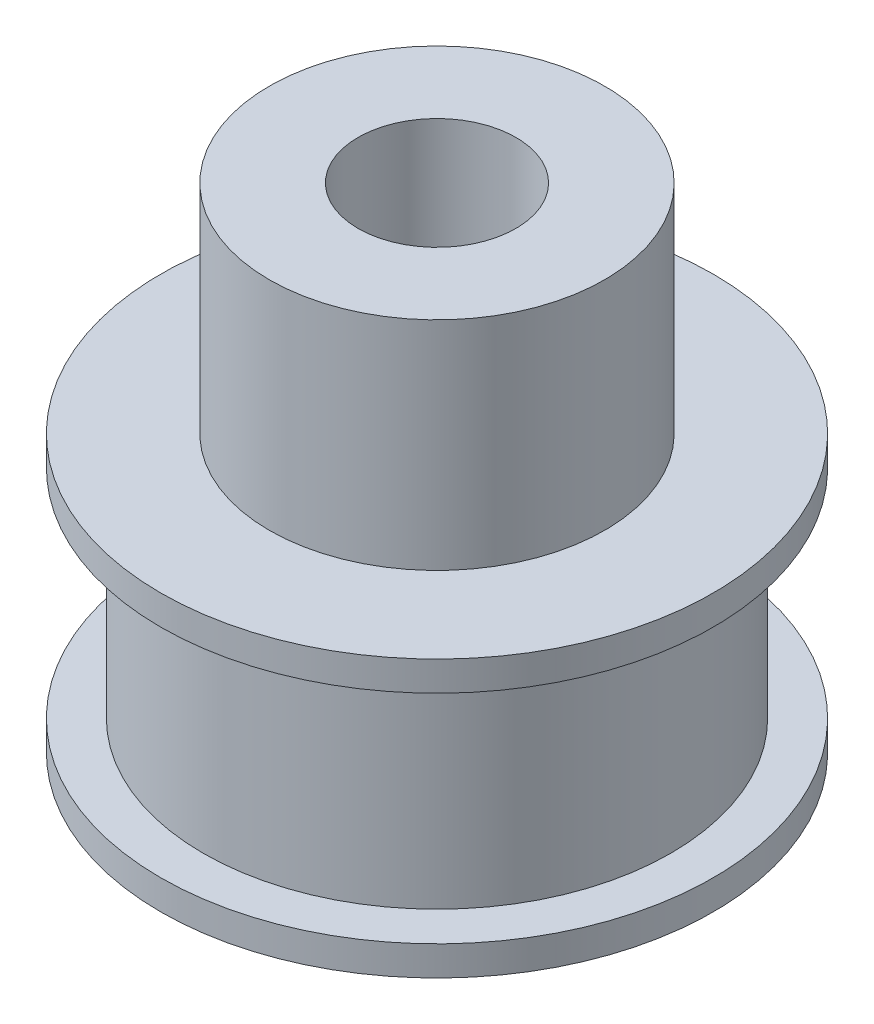
ISO-10303-21;
HEADER;
FILE_DESCRIPTION(('STEP AP214'),'2;1');
FILE_NAME('part.step','',(''),(''),'','','');
FILE_SCHEMA(('AUTOMOTIVE_DESIGN { 1 0 10303 214 1 1 1 1 }'));
ENDSEC;
DATA;
#1=APPLICATION_CONTEXT('core data for automotive mechanical design processes');
#2=APPLICATION_PROTOCOL_DEFINITION('international standard','automotive_design',2000,#1);
#3=PRODUCT_CONTEXT('',#1,'mechanical');
#4=PRODUCT('Part','Part','',(#3));
#5=PRODUCT_RELATED_PRODUCT_CATEGORY('part','',(#4));
#6=PRODUCT_DEFINITION_FORMATION('','',#4);
#7=PRODUCT_DEFINITION_CONTEXT('part definition',#1,'design');
#8=PRODUCT_DEFINITION('design','',#6,#7);
#9=PRODUCT_DEFINITION_SHAPE('','',#8);
#10=(LENGTH_UNIT() NAMED_UNIT(*) SI_UNIT(.MILLI.,.METRE.));
#11=(NAMED_UNIT(*) PLANE_ANGLE_UNIT() SI_UNIT($,.RADIAN.));
#12=(NAMED_UNIT(*) SI_UNIT($,.STERADIAN.) SOLID_ANGLE_UNIT());
#13=UNCERTAINTY_MEASURE_WITH_UNIT(LENGTH_MEASURE(1.E-05),#10,'distance_accuracy_value','');
#14=(GEOMETRIC_REPRESENTATION_CONTEXT(3) GLOBAL_UNCERTAINTY_ASSIGNED_CONTEXT((#13)) GLOBAL_UNIT_ASSIGNED_CONTEXT((#10,
#11,#12)) REPRESENTATION_CONTEXT('',''));
#15=CARTESIAN_POINT('',(0.,0.,0.));
#16=DIRECTION('',(0.,0.,1.));
#17=DIRECTION('',(1.,0.,0.));
#18=AXIS2_PLACEMENT_3D('',#15,#16,#17);
#19=CARTESIAN_POINT('',(0.,1.5,0.));
#20=DIRECTION('',(0.,-1.,0.));
#21=DIRECTION('',(0.,0.,-1.));
#22=AXIS2_PLACEMENT_3D('',#19,#20,#21);
#23=CYLINDRICAL_SURFACE('',#22,14.);
#24=CARTESIAN_POINT('',(0.,1.5,0.));
#25=DIRECTION('',(0.,1.,0.));
#26=DIRECTION('',(0.,0.,1.));
#27=AXIS2_PLACEMENT_3D('',#24,#25,#26);
#28=CIRCLE('',#27,14.);
#29=CARTESIAN_POINT('',(0.,1.5,14.));
#30=VERTEX_POINT('',#29);
#31=EDGE_CURVE('E10',#30,#30,#28,.T.);
#32=ORIENTED_EDGE('',*,*,#31,.F.);
#33=EDGE_LOOP('',(#32));
#34=FACE_BOUND('',#33,.T.);
#35=CARTESIAN_POINT('',(0.,0.,0.));
#36=DIRECTION('',(0.,1.,0.));
#37=DIRECTION('',(0.,0.,1.));
#38=AXIS2_PLACEMENT_3D('',#35,#36,#37);
#39=CIRCLE('',#38,14.);
#40=CARTESIAN_POINT('',(0.,0.,14.));
#41=VERTEX_POINT('',#40);
#42=EDGE_CURVE('E41',#41,#41,#39,.T.);
#43=ORIENTED_EDGE('',*,*,#42,.T.);
#44=EDGE_LOOP('',(#43));
#45=FACE_BOUND('',#44,.T.);
#46=ADVANCED_FACE('F38',(#34,#45),#23,.T.);
#47=CARTESIAN_POINT('',(0.,1.5,0.));
#48=DIRECTION('',(0.,1.,0.));
#49=DIRECTION('',(0.,0.,1.));
#50=AXIS2_PLACEMENT_3D('',#47,#48,#49);
#51=PLANE('',#50);
#52=CARTESIAN_POINT('',(0.,1.5,0.));
#53=DIRECTION('',(0.,1.,0.));
#54=DIRECTION('',(0.,0.,1.));
#55=AXIS2_PLACEMENT_3D('',#52,#53,#54);
#56=CIRCLE('',#55,11.85);
#57=CARTESIAN_POINT('',(0.,1.5,11.85));
#58=VERTEX_POINT('',#57);
#59=EDGE_CURVE('E52',#58,#58,#56,.T.);
#60=ORIENTED_EDGE('',*,*,#59,.F.);
#61=EDGE_LOOP('',(#60));
#62=FACE_BOUND('',#61,.T.);
#63=ORIENTED_EDGE('',*,*,#31,.T.);
#64=EDGE_LOOP('',(#63));
#65=FACE_BOUND('',#64,.T.);
#66=ADVANCED_FACE('F125',(#62,#65),#51,.T.);
#67=CARTESIAN_POINT('',(0.,0.,0.));
#68=DIRECTION('',(0.,1.,0.));
#69=DIRECTION('',(0.,0.,1.));
#70=AXIS2_PLACEMENT_3D('',#67,#68,#69);
#71=PLANE('',#70);
#72=CARTESIAN_POINT('',(0.,0.,0.));
#73=DIRECTION('',(0.,1.,0.));
#74=DIRECTION('',(0.,0.,1.));
#75=AXIS2_PLACEMENT_3D('',#72,#73,#74);
#76=CIRCLE('',#75,4.);
#77=CARTESIAN_POINT('',(0.,0.,4.));
#78=VERTEX_POINT('',#77);
#79=EDGE_CURVE('E72',#78,#78,#76,.T.);
#80=ORIENTED_EDGE('',*,*,#79,.T.);
#81=EDGE_LOOP('',(#80));
#82=FACE_BOUND('',#81,.T.);
#83=ORIENTED_EDGE('',*,*,#42,.F.);
#84=EDGE_LOOP('',(#83));
#85=FACE_BOUND('',#84,.T.);
#86=ADVANCED_FACE('F84',(#82,#85),#71,.F.);
#87=CARTESIAN_POINT('',(0.,12.5,0.));
#88=DIRECTION('',(0.,-1.,0.));
#89=DIRECTION('',(0.,0.,-1.));
#90=AXIS2_PLACEMENT_3D('',#87,#88,#89);
#91=CYLINDRICAL_SURFACE('',#90,11.85);
#92=CARTESIAN_POINT('',(0.,12.5,0.));
#93=DIRECTION('',(0.,1.,0.));
#94=DIRECTION('',(0.,0.,1.));
#95=AXIS2_PLACEMENT_3D('',#92,#93,#94);
#96=CIRCLE('',#95,11.85);
#97=CARTESIAN_POINT('',(0.,12.5,11.85));
#98=VERTEX_POINT('',#97);
#99=EDGE_CURVE('E50',#98,#98,#96,.T.);
#100=ORIENTED_EDGE('',*,*,#99,.F.);
#101=EDGE_LOOP('',(#100));
#102=FACE_BOUND('',#101,.T.);
#103=ORIENTED_EDGE('',*,*,#59,.T.);
#104=EDGE_LOOP('',(#103));
#105=FACE_BOUND('',#104,.T.);
#106=ADVANCED_FACE('F115',(#102,#105),#91,.T.);
#107=CARTESIAN_POINT('',(0.,14.,0.));
#108=DIRECTION('',(0.,-1.,0.));
#109=DIRECTION('',(0.,0.,-1.));
#110=AXIS2_PLACEMENT_3D('',#107,#108,#109);
#111=CYLINDRICAL_SURFACE('',#110,14.);
#112=CARTESIAN_POINT('',(0.,14.,0.));
#113=DIRECTION('',(0.,1.,0.));
#114=DIRECTION('',(0.,0.,1.));
#115=AXIS2_PLACEMENT_3D('',#112,#113,#114);
#116=CIRCLE('',#115,14.);
#117=CARTESIAN_POINT('',(0.,14.,14.));
#118=VERTEX_POINT('',#117);
#119=EDGE_CURVE('E56',#118,#118,#116,.T.);
#120=ORIENTED_EDGE('',*,*,#119,.F.);
#121=EDGE_LOOP('',(#120));
#122=FACE_BOUND('',#121,.T.);
#123=CARTESIAN_POINT('',(0.,12.5,0.));
#124=DIRECTION('',(0.,1.,0.));
#125=DIRECTION('',(0.,0.,1.));
#126=AXIS2_PLACEMENT_3D('',#123,#124,#125);
#127=CIRCLE('',#126,14.);
#128=CARTESIAN_POINT('',(0.,12.5,14.));
#129=VERTEX_POINT('',#128);
#130=EDGE_CURVE('E60',#129,#129,#127,.T.);
#131=ORIENTED_EDGE('',*,*,#130,.T.);
#132=EDGE_LOOP('',(#131));
#133=FACE_BOUND('',#132,.T.);
#134=ADVANCED_FACE('F109',(#122,#133),#111,.T.);
#135=CARTESIAN_POINT('',(0.,14.,0.));
#136=DIRECTION('',(0.,1.,0.));
#137=DIRECTION('',(0.,0.,1.));
#138=AXIS2_PLACEMENT_3D('',#135,#136,#137);
#139=PLANE('',#138);
#140=CARTESIAN_POINT('',(0.,14.,0.));
#141=DIRECTION('',(0.,1.,0.));
#142=DIRECTION('',(0.,0.,1.));
#143=AXIS2_PLACEMENT_3D('',#140,#141,#142);
#144=CIRCLE('',#143,8.5);
#145=CARTESIAN_POINT('',(0.,14.,8.5));
#146=VERTEX_POINT('',#145);
#147=EDGE_CURVE('E68',#146,#146,#144,.T.);
#148=ORIENTED_EDGE('',*,*,#147,.F.);
#149=EDGE_LOOP('',(#148));
#150=FACE_BOUND('',#149,.T.);
#151=ORIENTED_EDGE('',*,*,#119,.T.);
#152=EDGE_LOOP('',(#151));
#153=FACE_BOUND('',#152,.T.);
#154=ADVANCED_FACE('F106',(#150,#153),#139,.T.);
#155=CARTESIAN_POINT('',(0.,12.5,0.));
#156=DIRECTION('',(0.,1.,0.));
#157=DIRECTION('',(0.,0.,1.));
#158=AXIS2_PLACEMENT_3D('',#155,#156,#157);
#159=PLANE('',#158);
#160=ORIENTED_EDGE('',*,*,#99,.T.);
#161=EDGE_LOOP('',(#160));
#162=FACE_BOUND('',#161,.T.);
#163=ORIENTED_EDGE('',*,*,#130,.F.);
#164=EDGE_LOOP('',(#163));
#165=FACE_BOUND('',#164,.T.);
#166=ADVANCED_FACE('F102',(#162,#165),#159,.F.);
#167=CARTESIAN_POINT('',(0.,25.,0.));
#168=DIRECTION('',(0.,-1.,0.));
#169=DIRECTION('',(0.,0.,-1.));
#170=AXIS2_PLACEMENT_3D('',#167,#168,#169);
#171=CYLINDRICAL_SURFACE('',#170,8.5);
#172=CARTESIAN_POINT('',(0.,25.,0.));
#173=DIRECTION('',(0.,1.,0.));
#174=DIRECTION('',(0.,0.,1.));
#175=AXIS2_PLACEMENT_3D('',#172,#173,#174);
#176=CIRCLE('',#175,8.5);
#177=CARTESIAN_POINT('',(0.,25.,8.5));
#178=VERTEX_POINT('',#177);
#179=EDGE_CURVE('E64',#178,#178,#176,.T.);
#180=ORIENTED_EDGE('',*,*,#179,.F.);
#181=EDGE_LOOP('',(#180));
#182=FACE_BOUND('',#181,.T.);
#183=ORIENTED_EDGE('',*,*,#147,.T.);
#184=EDGE_LOOP('',(#183));
#185=FACE_BOUND('',#184,.T.);
#186=ADVANCED_FACE('F96',(#182,#185),#171,.T.);
#187=CARTESIAN_POINT('',(0.,25.,0.));
#188=DIRECTION('',(0.,1.,0.));
#189=DIRECTION('',(0.,0.,1.));
#190=AXIS2_PLACEMENT_3D('',#187,#188,#189);
#191=PLANE('',#190);
#192=CARTESIAN_POINT('',(0.,25.,0.));
#193=DIRECTION('',(0.,1.,0.));
#194=DIRECTION('',(0.,0.,1.));
#195=AXIS2_PLACEMENT_3D('',#192,#193,#194);
#196=CIRCLE('',#195,4.);
#197=CARTESIAN_POINT('',(0.,25.,4.));
#198=VERTEX_POINT('',#197);
#199=EDGE_CURVE('E76',#198,#198,#196,.T.);
#200=ORIENTED_EDGE('',*,*,#199,.F.);
#201=EDGE_LOOP('',(#200));
#202=FACE_BOUND('',#201,.T.);
#203=ORIENTED_EDGE('',*,*,#179,.T.);
#204=EDGE_LOOP('',(#203));
#205=FACE_BOUND('',#204,.T.);
#206=ADVANCED_FACE('F90',(#202,#205),#191,.T.);
#207=CARTESIAN_POINT('',(0.,0.,0.));
#208=DIRECTION('',(0.,1.,0.));
#209=DIRECTION('',(0.,0.,1.));
#210=AXIS2_PLACEMENT_3D('',#207,#208,#209);
#211=CYLINDRICAL_SURFACE('',#210,4.);
#212=ORIENTED_EDGE('',*,*,#79,.F.);
#213=EDGE_LOOP('',(#212));
#214=FACE_BOUND('',#213,.T.);
#215=ORIENTED_EDGE('',*,*,#199,.T.);
#216=EDGE_LOOP('',(#215));
#217=FACE_BOUND('',#216,.T.);
#218=ADVANCED_FACE('F87',(#214,#217),#211,.F.);
#219=CLOSED_SHELL('',(#46,#66,#86,#106,#134,#154,#166,#186,#206,#218));
#220=MANIFOLD_SOLID_BREP('B2',#219);
#221=ADVANCED_BREP_SHAPE_REPRESENTATION('',(#18,#220),#14);
#222=SHAPE_DEFINITION_REPRESENTATION(#9,#221);
ENDSEC;
END-ISO-10303-21;
